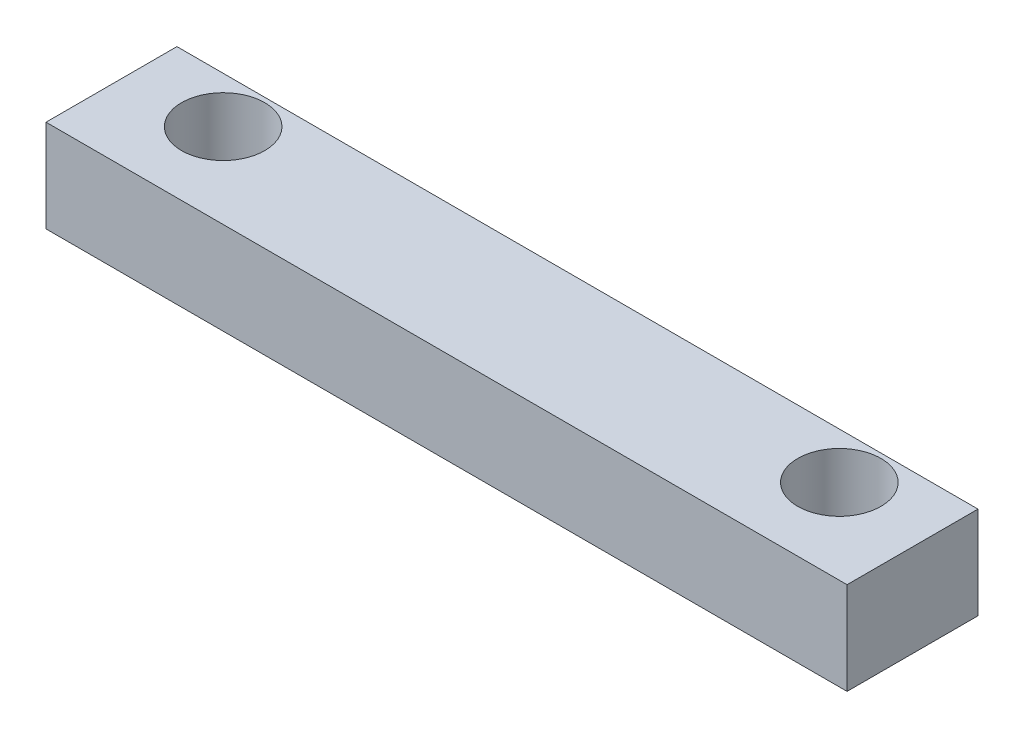
ISO-10303-21;
HEADER;
FILE_DESCRIPTION(('STEP AP214'),'2;1');
FILE_NAME('part.step','',(''),(''),'','','');
FILE_SCHEMA(('AUTOMOTIVE_DESIGN { 1 0 10303 214 1 1 1 1 }'));
ENDSEC;
DATA;
#1=APPLICATION_CONTEXT('core data for automotive mechanical design processes');
#2=APPLICATION_PROTOCOL_DEFINITION('international standard','automotive_design',2000,#1);
#3=PRODUCT_CONTEXT('',#1,'mechanical');
#4=PRODUCT('Part','Part','',(#3));
#5=PRODUCT_RELATED_PRODUCT_CATEGORY('part','',(#4));
#6=PRODUCT_DEFINITION_FORMATION('','',#4);
#7=PRODUCT_DEFINITION_CONTEXT('part definition',#1,'design');
#8=PRODUCT_DEFINITION('design','',#6,#7);
#9=PRODUCT_DEFINITION_SHAPE('','',#8);
#10=(LENGTH_UNIT() NAMED_UNIT(*) SI_UNIT(.MILLI.,.METRE.));
#11=(NAMED_UNIT(*) PLANE_ANGLE_UNIT() SI_UNIT($,.RADIAN.));
#12=(NAMED_UNIT(*) SI_UNIT($,.STERADIAN.) SOLID_ANGLE_UNIT());
#13=UNCERTAINTY_MEASURE_WITH_UNIT(LENGTH_MEASURE(1.E-05),#10,'distance_accuracy_value','');
#14=(GEOMETRIC_REPRESENTATION_CONTEXT(3) GLOBAL_UNCERTAINTY_ASSIGNED_CONTEXT((#13)) GLOBAL_UNIT_ASSIGNED_CONTEXT((#10,
#11,#12)) REPRESENTATION_CONTEXT('',''));
#15=CARTESIAN_POINT('',(0.,0.,0.));
#16=DIRECTION('',(0.,0.,1.));
#17=DIRECTION('',(1.,0.,0.));
#18=AXIS2_PLACEMENT_3D('',#15,#16,#17);
#19=CARTESIAN_POINT('',(0.,13.,0.));
#20=DIRECTION('',(1.,0.,0.));
#21=DIRECTION('',(0.,0.,-1.));
#22=AXIS2_PLACEMENT_3D('',#19,#20,#21);
#23=PLANE('',#22);
#24=DIRECTION('',(0.,1.,0.));
#25=VECTOR('',#24,1.);
#26=CARTESIAN_POINT('',(0.,0.,-4.25));
#27=LINE('',#26,#25);
#28=CARTESIAN_POINT('',(0.,9.99999999999999,-4.25));
#29=VERTEX_POINT('',#28);
#30=CARTESIAN_POINT('',(0.,13.,-4.25));
#31=VERTEX_POINT('',#30);
#32=EDGE_CURVE('E102',#29,#31,#27,.T.);
#33=ORIENTED_EDGE('',*,*,#32,.F.);
#34=DIRECTION('',(0.,0.,1.));
#35=VECTOR('',#34,1.);
#36=CARTESIAN_POINT('',(0.,10.,-4.25));
#37=LINE('',#36,#35);
#38=CARTESIAN_POINT('',(0.,10.,0.));
#39=VERTEX_POINT('',#38);
#40=EDGE_CURVE('E53',#29,#39,#37,.T.);
#41=ORIENTED_EDGE('',*,*,#40,.T.);
#42=DIRECTION('',(0.,-1.,0.));
#43=VECTOR('',#42,1.);
#44=CARTESIAN_POINT('',(0.,13.,0.));
#45=LINE('',#44,#43);
#46=CARTESIAN_POINT('',(0.,13.,0.));
#47=VERTEX_POINT('',#46);
#48=EDGE_CURVE('E11',#47,#39,#45,.T.);
#49=ORIENTED_EDGE('',*,*,#48,.F.);
#50=DIRECTION('',(0.,0.,1.));
#51=VECTOR('',#50,1.);
#52=CARTESIAN_POINT('',(0.,13.,0.));
#53=LINE('',#52,#51);
#54=EDGE_CURVE('E116',#31,#47,#53,.T.);
#55=ORIENTED_EDGE('',*,*,#54,.F.);
#56=EDGE_LOOP('',(#33,#41,#49,#55));
#57=FACE_BOUND('',#56,.T.);
#58=ADVANCED_FACE('F38',(#57),#23,.F.);
#59=CARTESIAN_POINT('',(0.,13.,0.));
#60=DIRECTION('',(0.,0.,-1.));
#61=DIRECTION('',(-1.,0.,0.));
#62=AXIS2_PLACEMENT_3D('',#59,#60,#61);
#63=PLANE('',#62);
#64=ORIENTED_EDGE('',*,*,#48,.T.);
#65=DIRECTION('',(-1.,0.,0.));
#66=VECTOR('',#65,1.);
#67=CARTESIAN_POINT('',(0.,10.,0.));
#68=LINE('',#67,#66);
#69=CARTESIAN_POINT('',(26.,10.,0.));
#70=VERTEX_POINT('',#69);
#71=EDGE_CURVE('E87',#70,#39,#68,.T.);
#72=ORIENTED_EDGE('',*,*,#71,.F.);
#73=DIRECTION('',(0.,-1.,0.));
#74=VECTOR('',#73,1.);
#75=CARTESIAN_POINT('',(26.,13.,0.));
#76=LINE('',#75,#74);
#77=CARTESIAN_POINT('',(26.,13.,0.));
#78=VERTEX_POINT('',#77);
#79=EDGE_CURVE('E46',#78,#70,#76,.T.);
#80=ORIENTED_EDGE('',*,*,#79,.F.);
#81=DIRECTION('',(1.,0.,0.));
#82=VECTOR('',#81,1.);
#83=CARTESIAN_POINT('',(0.,13.,0.));
#84=LINE('',#83,#82);
#85=EDGE_CURVE('E61',#47,#78,#84,.T.);
#86=ORIENTED_EDGE('',*,*,#85,.F.);
#87=EDGE_LOOP('',(#64,#72,#80,#86));
#88=FACE_BOUND('',#87,.T.);
#89=ADVANCED_FACE('F131',(#88),#63,.F.);
#90=CARTESIAN_POINT('',(26.,13.,0.));
#91=DIRECTION('',(-1.,0.,0.));
#92=DIRECTION('',(0.,0.,1.));
#93=AXIS2_PLACEMENT_3D('',#90,#91,#92);
#94=PLANE('',#93);
#95=ORIENTED_EDGE('',*,*,#79,.T.);
#96=DIRECTION('',(0.,0.,1.));
#97=VECTOR('',#96,1.);
#98=CARTESIAN_POINT('',(26.,10.,-4.25));
#99=LINE('',#98,#97);
#100=CARTESIAN_POINT('',(26.,10.,-4.25));
#101=VERTEX_POINT('',#100);
#102=EDGE_CURVE('E81',#101,#70,#99,.T.);
#103=ORIENTED_EDGE('',*,*,#102,.F.);
#104=DIRECTION('',(0.,1.,0.));
#105=VECTOR('',#104,1.);
#106=CARTESIAN_POINT('',(26.,0.,-4.25));
#107=LINE('',#106,#105);
#108=CARTESIAN_POINT('',(26.,13.,-4.25));
#109=VERTEX_POINT('',#108);
#110=EDGE_CURVE('E93',#101,#109,#107,.T.);
#111=ORIENTED_EDGE('',*,*,#110,.T.);
#112=DIRECTION('',(0.,0.,-1.));
#113=VECTOR('',#112,1.);
#114=CARTESIAN_POINT('',(26.,13.,0.));
#115=LINE('',#114,#113);
#116=EDGE_CURVE('E121',#78,#109,#115,.T.);
#117=ORIENTED_EDGE('',*,*,#116,.F.);
#118=EDGE_LOOP('',(#95,#103,#111,#117));
#119=FACE_BOUND('',#118,.T.);
#120=ADVANCED_FACE('F91',(#119),#94,.F.);
#121=CARTESIAN_POINT('',(0.,13.,0.));
#122=DIRECTION('',(0.,-1.,0.));
#123=DIRECTION('',(0.,0.,-1.));
#124=AXIS2_PLACEMENT_3D('',#121,#122,#123);
#125=PLANE('',#124);
#126=CARTESIAN_POINT('',(3.,13.,-2.75));
#127=DIRECTION('',(0.,1.,0.));
#128=DIRECTION('',(0.,0.,1.));
#129=AXIS2_PLACEMENT_3D('',#126,#127,#128);
#130=CIRCLE('',#129,1.35);
#131=CARTESIAN_POINT('',(3.,13.,-1.4));
#132=VERTEX_POINT('',#131);
#133=EDGE_CURVE('E107',#132,#132,#130,.T.);
#134=ORIENTED_EDGE('',*,*,#133,.F.);
#135=EDGE_LOOP('',(#134));
#136=FACE_BOUND('',#135,.T.);
#137=CARTESIAN_POINT('',(23.,13.,-2.75));
#138=DIRECTION('',(0.,1.,0.));
#139=DIRECTION('',(0.,0.,1.));
#140=AXIS2_PLACEMENT_3D('',#137,#138,#139);
#141=CIRCLE('',#140,1.35);
#142=CARTESIAN_POINT('',(23.,13.,-1.4));
#143=VERTEX_POINT('',#142);
#144=EDGE_CURVE('E101',#143,#143,#141,.T.);
#145=ORIENTED_EDGE('',*,*,#144,.F.);
#146=EDGE_LOOP('',(#145));
#147=FACE_BOUND('',#146,.T.);
#148=ORIENTED_EDGE('',*,*,#116,.T.);
#149=DIRECTION('',(1.,0.,0.));
#150=VECTOR('',#149,1.);
#151=CARTESIAN_POINT('',(0.,13.,-4.25));
#152=LINE('',#151,#150);
#153=EDGE_CURVE('E99',#31,#109,#152,.T.);
#154=ORIENTED_EDGE('',*,*,#153,.F.);
#155=ORIENTED_EDGE('',*,*,#54,.T.);
#156=ORIENTED_EDGE('',*,*,#85,.T.);
#157=EDGE_LOOP('',(#148,#154,#155,#156));
#158=FACE_BOUND('',#157,.T.);
#159=ADVANCED_FACE('F124',(#136,#147,#158),#125,.F.);
#160=CARTESIAN_POINT('',(23.,0.,-2.75));
#161=DIRECTION('',(0.,1.,0.));
#162=DIRECTION('',(0.,0.,1.));
#163=AXIS2_PLACEMENT_3D('',#160,#161,#162);
#164=CYLINDRICAL_SURFACE('',#163,1.35);
#165=CARTESIAN_POINT('',(23.,10.,-2.75));
#166=DIRECTION('',(0.,1.,0.));
#167=DIRECTION('',(0.,0.,1.));
#168=AXIS2_PLACEMENT_3D('',#165,#166,#167);
#169=CIRCLE('',#168,1.35);
#170=CARTESIAN_POINT('',(23.,10.,-1.4));
#171=VERTEX_POINT('',#170);
#172=EDGE_CURVE('E127',#171,#171,#169,.F.);
#173=ORIENTED_EDGE('',*,*,#172,.T.);
#174=EDGE_LOOP('',(#173));
#175=FACE_BOUND('',#174,.T.);
#176=ORIENTED_EDGE('',*,*,#144,.T.);
#177=EDGE_LOOP('',(#176));
#178=FACE_BOUND('',#177,.T.);
#179=ADVANCED_FACE('F144',(#175,#178),#164,.F.);
#180=CARTESIAN_POINT('',(3.,0.,-2.75));
#181=DIRECTION('',(0.,1.,0.));
#182=DIRECTION('',(0.,0.,1.));
#183=AXIS2_PLACEMENT_3D('',#180,#181,#182);
#184=CYLINDRICAL_SURFACE('',#183,1.35);
#185=CARTESIAN_POINT('',(3.,10.,-2.75));
#186=DIRECTION('',(0.,1.,0.));
#187=DIRECTION('',(0.,0.,1.));
#188=AXIS2_PLACEMENT_3D('',#185,#186,#187);
#189=CIRCLE('',#188,1.35);
#190=CARTESIAN_POINT('',(3.,10.,-1.4));
#191=VERTEX_POINT('',#190);
#192=EDGE_CURVE('E136',#191,#191,#189,.F.);
#193=ORIENTED_EDGE('',*,*,#192,.T.);
#194=EDGE_LOOP('',(#193));
#195=FACE_BOUND('',#194,.T.);
#196=ORIENTED_EDGE('',*,*,#133,.T.);
#197=EDGE_LOOP('',(#196));
#198=FACE_BOUND('',#197,.T.);
#199=ADVANCED_FACE('F152',(#195,#198),#184,.F.);
#200=CARTESIAN_POINT('',(0.,0.,-4.25));
#201=DIRECTION('',(0.,0.,1.));
#202=DIRECTION('',(1.,0.,0.));
#203=AXIS2_PLACEMENT_3D('',#200,#201,#202);
#204=PLANE('',#203);
#205=ORIENTED_EDGE('',*,*,#110,.F.);
#206=DIRECTION('',(-1.,0.,0.));
#207=VECTOR('',#206,1.);
#208=CARTESIAN_POINT('',(0.,10.,-4.25));
#209=LINE('',#208,#207);
#210=EDGE_CURVE('E77',#101,#29,#209,.T.);
#211=ORIENTED_EDGE('',*,*,#210,.T.);
#212=ORIENTED_EDGE('',*,*,#32,.T.);
#213=ORIENTED_EDGE('',*,*,#153,.T.);
#214=EDGE_LOOP('',(#205,#211,#212,#213));
#215=FACE_BOUND('',#214,.T.);
#216=ADVANCED_FACE('F97',(#215),#204,.F.);
#217=CARTESIAN_POINT('',(0.,10.,-4.25));
#218=DIRECTION('',(0.,1.,0.));
#219=DIRECTION('',(0.,0.,1.));
#220=AXIS2_PLACEMENT_3D('',#217,#218,#219);
#221=PLANE('',#220);
#222=ORIENTED_EDGE('',*,*,#192,.F.);
#223=EDGE_LOOP('',(#222));
#224=FACE_BOUND('',#223,.T.);
#225=ORIENTED_EDGE('',*,*,#71,.T.);
#226=ORIENTED_EDGE('',*,*,#40,.F.);
#227=ORIENTED_EDGE('',*,*,#210,.F.);
#228=ORIENTED_EDGE('',*,*,#102,.T.);
#229=EDGE_LOOP('',(#225,#226,#227,#228));
#230=FACE_BOUND('',#229,.T.);
#231=ORIENTED_EDGE('',*,*,#172,.F.);
#232=EDGE_LOOP('',(#231));
#233=FACE_BOUND('',#232,.T.);
#234=ADVANCED_FACE('F79',(#224,#230,#233),#221,.F.);
#235=CLOSED_SHELL('',(#58,#89,#120,#159,#179,#199,#216,#234));
#236=MANIFOLD_SOLID_BREP('B2',#235);
#237=ADVANCED_BREP_SHAPE_REPRESENTATION('',(#18,#236),#14);
#238=SHAPE_DEFINITION_REPRESENTATION(#9,#237);
ENDSEC;
END-ISO-10303-21;
